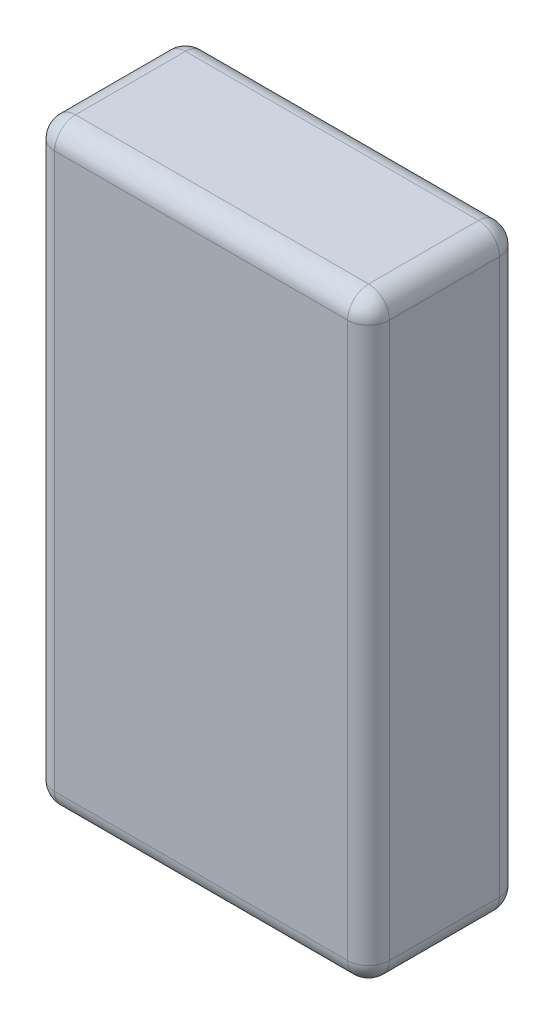
ISO-10303-21;
HEADER;
FILE_DESCRIPTION(('STEP AP214'),'2;1');
FILE_NAME('part.step','',(''),(''),'','','');
FILE_SCHEMA(('AUTOMOTIVE_DESIGN { 1 0 10303 214 1 1 1 1 }'));
ENDSEC;
DATA;
#1=APPLICATION_CONTEXT('core data for automotive mechanical design processes');
#2=APPLICATION_PROTOCOL_DEFINITION('international standard','automotive_design',2000,#1);
#3=PRODUCT_CONTEXT('',#1,'mechanical');
#4=PRODUCT('Part','Part','',(#3));
#5=PRODUCT_RELATED_PRODUCT_CATEGORY('part','',(#4));
#6=PRODUCT_DEFINITION_FORMATION('','',#4);
#7=PRODUCT_DEFINITION_CONTEXT('part definition',#1,'design');
#8=PRODUCT_DEFINITION('design','',#6,#7);
#9=PRODUCT_DEFINITION_SHAPE('','',#8);
#10=(LENGTH_UNIT() NAMED_UNIT(*) SI_UNIT(.MILLI.,.METRE.));
#11=(NAMED_UNIT(*) PLANE_ANGLE_UNIT() SI_UNIT($,.RADIAN.));
#12=(NAMED_UNIT(*) SI_UNIT($,.STERADIAN.) SOLID_ANGLE_UNIT());
#13=UNCERTAINTY_MEASURE_WITH_UNIT(LENGTH_MEASURE(1.E-05),#10,'distance_accuracy_value','');
#14=(GEOMETRIC_REPRESENTATION_CONTEXT(3) GLOBAL_UNCERTAINTY_ASSIGNED_CONTEXT((#13)) GLOBAL_UNIT_ASSIGNED_CONTEXT((#10,
#11,#12)) REPRESENTATION_CONTEXT('',''));
#15=CARTESIAN_POINT('',(0.,0.,0.));
#16=DIRECTION('',(0.,0.,1.));
#17=DIRECTION('',(1.,0.,0.));
#18=AXIS2_PLACEMENT_3D('',#15,#16,#17);
#19=CARTESIAN_POINT('',(0.,57.,0.));
#20=DIRECTION('',(1.,0.,0.));
#21=DIRECTION('',(0.,0.,-1.));
#22=AXIS2_PLACEMENT_3D('',#19,#20,#21);
#23=PLANE('',#22);
#24=DIRECTION('',(0.,0.,1.));
#25=VECTOR('',#24,1.);
#26=CARTESIAN_POINT('',(0.,55.,0.));
#27=LINE('',#26,#25);
#28=CARTESIAN_POINT('',(0.,55.,-2.));
#29=VERTEX_POINT('',#28);
#30=CARTESIAN_POINT('',(0.,55.,-12.5));
#31=VERTEX_POINT('',#30);
#32=EDGE_CURVE('E199',#29,#31,#27,.F.);
#33=ORIENTED_EDGE('',*,*,#32,.T.);
#34=DIRECTION('',(0.,-1.,0.));
#35=VECTOR('',#34,1.);
#36=CARTESIAN_POINT('',(0.,57.,-12.5));
#37=LINE('',#36,#35);
#38=CARTESIAN_POINT('',(0.,2.,-12.5));
#39=VERTEX_POINT('',#38);
#40=EDGE_CURVE('E201',#31,#39,#37,.T.);
#41=ORIENTED_EDGE('',*,*,#40,.T.);
#42=DIRECTION('',(0.,0.,1.));
#43=VECTOR('',#42,1.);
#44=CARTESIAN_POINT('',(0.,2.,0.));
#45=LINE('',#44,#43);
#46=CARTESIAN_POINT('',(0.,2.,-2.));
#47=VERTEX_POINT('',#46);
#48=EDGE_CURVE('E197',#39,#47,#45,.T.);
#49=ORIENTED_EDGE('',*,*,#48,.T.);
#50=DIRECTION('',(0.,-1.,0.));
#51=VECTOR('',#50,1.);
#52=CARTESIAN_POINT('',(0.,57.,-2.));
#53=LINE('',#52,#51);
#54=EDGE_CURVE('E195',#47,#29,#53,.F.);
#55=ORIENTED_EDGE('',*,*,#54,.T.);
#56=EDGE_LOOP('',(#33,#41,#49,#55));
#57=FACE_BOUND('',#56,.T.);
#58=ADVANCED_FACE('F43',(#57),#23,.F.);
#59=CARTESIAN_POINT('',(0.,57.,0.));
#60=DIRECTION('',(0.,0.,-1.));
#61=DIRECTION('',(-1.,0.,0.));
#62=AXIS2_PLACEMENT_3D('',#59,#60,#61);
#63=PLANE('',#62);
#64=DIRECTION('',(1.,0.,0.));
#65=VECTOR('',#64,1.);
#66=CARTESIAN_POINT('',(0.,55.,0.));
#67=LINE('',#66,#65);
#68=CARTESIAN_POINT('',(30.,55.,0.));
#69=VERTEX_POINT('',#68);
#70=CARTESIAN_POINT('',(2.,55.,0.));
#71=VERTEX_POINT('',#70);
#72=EDGE_CURVE('E52',#69,#71,#67,.F.);
#73=ORIENTED_EDGE('',*,*,#72,.T.);
#74=DIRECTION('',(0.,-1.,0.));
#75=VECTOR('',#74,1.);
#76=CARTESIAN_POINT('',(2.,57.,0.));
#77=LINE('',#76,#75);
#78=CARTESIAN_POINT('',(2.,2.,0.));
#79=VERTEX_POINT('',#78);
#80=EDGE_CURVE('E11',#71,#79,#77,.T.);
#81=ORIENTED_EDGE('',*,*,#80,.T.);
#82=DIRECTION('',(1.,0.,0.));
#83=VECTOR('',#82,1.);
#84=CARTESIAN_POINT('',(32.,2.,0.));
#85=LINE('',#84,#83);
#86=CARTESIAN_POINT('',(30.,2.,0.));
#87=VERTEX_POINT('',#86);
#88=EDGE_CURVE('E204',#79,#87,#85,.T.);
#89=ORIENTED_EDGE('',*,*,#88,.T.);
#90=DIRECTION('',(0.,-1.,0.));
#91=VECTOR('',#90,1.);
#92=CARTESIAN_POINT('',(30.,57.,0.));
#93=LINE('',#92,#91);
#94=EDGE_CURVE('E63',#87,#69,#93,.F.);
#95=ORIENTED_EDGE('',*,*,#94,.T.);
#96=EDGE_LOOP('',(#73,#81,#89,#95));
#97=FACE_BOUND('',#96,.T.);
#98=ADVANCED_FACE('F306',(#97),#63,.F.);
#99=CARTESIAN_POINT('',(32.,57.,0.));
#100=DIRECTION('',(-1.,0.,0.));
#101=DIRECTION('',(0.,0.,1.));
#102=AXIS2_PLACEMENT_3D('',#99,#100,#101);
#103=PLANE('',#102);
#104=DIRECTION('',(0.,0.,-1.));
#105=VECTOR('',#104,1.);
#106=CARTESIAN_POINT('',(32.,2.,-14.5));
#107=LINE('',#106,#105);
#108=CARTESIAN_POINT('',(32.,2.,-2.));
#109=VERTEX_POINT('',#108);
#110=CARTESIAN_POINT('',(32.,2.,-12.5));
#111=VERTEX_POINT('',#110);
#112=EDGE_CURVE('E181',#109,#111,#107,.T.);
#113=ORIENTED_EDGE('',*,*,#112,.T.);
#114=DIRECTION('',(0.,-1.,0.));
#115=VECTOR('',#114,1.);
#116=CARTESIAN_POINT('',(32.,57.,-12.5));
#117=LINE('',#116,#115);
#118=CARTESIAN_POINT('',(32.,55.,-12.5));
#119=VERTEX_POINT('',#118);
#120=EDGE_CURVE('E183',#111,#119,#117,.F.);
#121=ORIENTED_EDGE('',*,*,#120,.T.);
#122=DIRECTION('',(0.,0.,-1.));
#123=VECTOR('',#122,1.);
#124=CARTESIAN_POINT('',(32.,55.,0.));
#125=LINE('',#124,#123);
#126=CARTESIAN_POINT('',(32.,55.,-2.));
#127=VERTEX_POINT('',#126);
#128=EDGE_CURVE('E179',#119,#127,#125,.F.);
#129=ORIENTED_EDGE('',*,*,#128,.T.);
#130=DIRECTION('',(0.,-1.,0.));
#131=VECTOR('',#130,1.);
#132=CARTESIAN_POINT('',(32.,57.,-2.));
#133=LINE('',#132,#131);
#134=EDGE_CURVE('E177',#127,#109,#133,.T.);
#135=ORIENTED_EDGE('',*,*,#134,.T.);
#136=EDGE_LOOP('',(#113,#121,#129,#135));
#137=FACE_BOUND('',#136,.T.);
#138=ADVANCED_FACE('F278',(#137),#103,.F.);
#139=CARTESIAN_POINT('',(0.,57.,-14.5));
#140=DIRECTION('',(0.,0.,1.));
#141=DIRECTION('',(1.,0.,0.));
#142=AXIS2_PLACEMENT_3D('',#139,#140,#141);
#143=PLANE('',#142);
#144=DIRECTION('',(0.,-1.,0.));
#145=VECTOR('',#144,1.);
#146=CARTESIAN_POINT('',(30.,57.,-14.5));
#147=LINE('',#146,#145);
#148=CARTESIAN_POINT('',(30.,55.,-14.5));
#149=VERTEX_POINT('',#148);
#150=CARTESIAN_POINT('',(30.,2.,-14.5));
#151=VERTEX_POINT('',#150);
#152=EDGE_CURVE('E164',#149,#151,#147,.T.);
#153=ORIENTED_EDGE('',*,*,#152,.T.);
#154=DIRECTION('',(-1.,0.,0.));
#155=VECTOR('',#154,1.);
#156=CARTESIAN_POINT('',(0.,2.,-14.5));
#157=LINE('',#156,#155);
#158=CARTESIAN_POINT('',(2.,2.,-14.5));
#159=VERTEX_POINT('',#158);
#160=EDGE_CURVE('E136',#151,#159,#157,.T.);
#161=ORIENTED_EDGE('',*,*,#160,.T.);
#162=DIRECTION('',(0.,-1.,0.));
#163=VECTOR('',#162,1.);
#164=CARTESIAN_POINT('',(2.,57.,-14.5));
#165=LINE('',#164,#163);
#166=CARTESIAN_POINT('',(2.,55.,-14.5));
#167=VERTEX_POINT('',#166);
#168=EDGE_CURVE('E154',#159,#167,#165,.F.);
#169=ORIENTED_EDGE('',*,*,#168,.T.);
#170=DIRECTION('',(-1.,0.,0.));
#171=VECTOR('',#170,1.);
#172=CARTESIAN_POINT('',(0.,55.,-14.5));
#173=LINE('',#172,#171);
#174=EDGE_CURVE('E160',#167,#149,#173,.F.);
#175=ORIENTED_EDGE('',*,*,#174,.T.);
#176=EDGE_LOOP('',(#153,#161,#169,#175));
#177=FACE_BOUND('',#176,.T.);
#178=ADVANCED_FACE('F162',(#177),#143,.F.);
#179=CARTESIAN_POINT('',(0.,57.,0.));
#180=DIRECTION('',(0.,-1.,0.));
#181=DIRECTION('',(0.,0.,-1.));
#182=AXIS2_PLACEMENT_3D('',#179,#180,#181);
#183=PLANE('',#182);
#184=DIRECTION('',(0.,0.,-1.));
#185=VECTOR('',#184,1.);
#186=CARTESIAN_POINT('',(30.,57.,0.));
#187=LINE('',#186,#185);
#188=CARTESIAN_POINT('',(30.,57.,-2.));
#189=VERTEX_POINT('',#188);
#190=CARTESIAN_POINT('',(30.,57.,-12.5));
#191=VERTEX_POINT('',#190);
#192=EDGE_CURVE('E190',#189,#191,#187,.T.);
#193=ORIENTED_EDGE('',*,*,#192,.T.);
#194=DIRECTION('',(-1.,0.,0.));
#195=VECTOR('',#194,1.);
#196=CARTESIAN_POINT('',(0.,57.,-12.5));
#197=LINE('',#196,#195);
#198=CARTESIAN_POINT('',(2.,57.,-12.5));
#199=VERTEX_POINT('',#198);
#200=EDGE_CURVE('E192',#191,#199,#197,.T.);
#201=ORIENTED_EDGE('',*,*,#200,.T.);
#202=DIRECTION('',(0.,0.,1.));
#203=VECTOR('',#202,1.);
#204=CARTESIAN_POINT('',(2.,57.,0.));
#205=LINE('',#204,#203);
#206=CARTESIAN_POINT('',(2.,57.,-2.));
#207=VERTEX_POINT('',#206);
#208=EDGE_CURVE('E188',#199,#207,#205,.T.);
#209=ORIENTED_EDGE('',*,*,#208,.T.);
#210=DIRECTION('',(1.,0.,0.));
#211=VECTOR('',#210,1.);
#212=CARTESIAN_POINT('',(0.,57.,-2.));
#213=LINE('',#212,#211);
#214=EDGE_CURVE('E186',#207,#189,#213,.T.);
#215=ORIENTED_EDGE('',*,*,#214,.T.);
#216=EDGE_LOOP('',(#193,#201,#209,#215));
#217=FACE_BOUND('',#216,.T.);
#218=ADVANCED_FACE('F287',(#217),#183,.F.);
#219=CARTESIAN_POINT('',(0.,0.,0.));
#220=DIRECTION('',(0.,-1.,0.));
#221=DIRECTION('',(0.,0.,-1.));
#222=AXIS2_PLACEMENT_3D('',#219,#220,#221);
#223=PLANE('',#222);
#224=DIRECTION('',(0.,0.,1.));
#225=VECTOR('',#224,1.);
#226=CARTESIAN_POINT('',(2.,0.,-14.5));
#227=LINE('',#226,#225);
#228=CARTESIAN_POINT('',(2.,0.,-2.));
#229=VERTEX_POINT('',#228);
#230=CARTESIAN_POINT('',(2.,0.,-12.5));
#231=VERTEX_POINT('',#230);
#232=EDGE_CURVE('E168',#229,#231,#227,.F.);
#233=ORIENTED_EDGE('',*,*,#232,.T.);
#234=DIRECTION('',(-1.,0.,0.));
#235=VECTOR('',#234,1.);
#236=CARTESIAN_POINT('',(32.,0.,-12.5));
#237=LINE('',#236,#235);
#238=CARTESIAN_POINT('',(30.,0.,-12.5));
#239=VERTEX_POINT('',#238);
#240=EDGE_CURVE('E138',#231,#239,#237,.F.);
#241=ORIENTED_EDGE('',*,*,#240,.T.);
#242=DIRECTION('',(0.,0.,-1.));
#243=VECTOR('',#242,1.);
#244=CARTESIAN_POINT('',(30.,0.,0.));
#245=LINE('',#244,#243);
#246=CARTESIAN_POINT('',(30.,0.,-2.));
#247=VERTEX_POINT('',#246);
#248=EDGE_CURVE('E174',#239,#247,#245,.F.);
#249=ORIENTED_EDGE('',*,*,#248,.T.);
#250=DIRECTION('',(1.,0.,0.));
#251=VECTOR('',#250,1.);
#252=CARTESIAN_POINT('',(0.,0.,-2.));
#253=LINE('',#252,#251);
#254=EDGE_CURVE('E166',#247,#229,#253,.F.);
#255=ORIENTED_EDGE('',*,*,#254,.T.);
#256=EDGE_LOOP('',(#233,#241,#249,#255));
#257=FACE_BOUND('',#256,.T.);
#258=ADVANCED_FACE('F366',(#257),#223,.T.);
#259=CARTESIAN_POINT('',(0.,55.,-2.));
#260=DIRECTION('',(1.,0.,0.));
#261=DIRECTION('',(0.,0.,-1.));
#262=AXIS2_PLACEMENT_3D('',#259,#260,#261);
#263=CYLINDRICAL_SURFACE('',#262,2.);
#264=CARTESIAN_POINT('',(30.,55.,-2.));
#265=DIRECTION('',(1.,0.,0.));
#266=DIRECTION('',(0.,0.,-1.));
#267=AXIS2_PLACEMENT_3D('',#264,#265,#266);
#268=CIRCLE('',#267,2.);
#269=EDGE_CURVE('E47',#189,#69,#268,.T.);
#270=ORIENTED_EDGE('',*,*,#269,.F.);
#271=ORIENTED_EDGE('',*,*,#214,.F.);
#272=CARTESIAN_POINT('',(2.,55.,-2.));
#273=DIRECTION('',(-1.,0.,0.));
#274=DIRECTION('',(0.,-1.,0.));
#275=AXIS2_PLACEMENT_3D('',#272,#273,#274);
#276=CIRCLE('',#275,2.);
#277=EDGE_CURVE('E257',#71,#207,#276,.T.);
#278=ORIENTED_EDGE('',*,*,#277,.F.);
#279=ORIENTED_EDGE('',*,*,#72,.F.);
#280=EDGE_LOOP('',(#270,#271,#278,#279));
#281=FACE_BOUND('',#280,.T.);
#282=ADVANCED_FACE('F45',(#281),#263,.T.);
#283=CARTESIAN_POINT('',(30.,55.,-2.));
#284=DIRECTION('',(0.,0.,1.));
#285=DIRECTION('',(1.,0.,0.));
#286=AXIS2_PLACEMENT_3D('',#283,#284,#285);
#287=SPHERICAL_SURFACE('',#286,2.);
#288=CARTESIAN_POINT('',(30.,55.,-2.));
#289=DIRECTION('',(0.,0.,1.));
#290=DIRECTION('',(0.,-1.,0.));
#291=AXIS2_PLACEMENT_3D('',#288,#289,#290);
#292=CIRCLE('',#291,2.);
#293=EDGE_CURVE('E252',#189,#127,#292,.F.);
#294=ORIENTED_EDGE('',*,*,#293,.F.);
#295=ORIENTED_EDGE('',*,*,#269,.T.);
#296=CARTESIAN_POINT('',(30.,55.,-2.));
#297=DIRECTION('',(0.,1.,0.));
#298=DIRECTION('',(0.,0.,1.));
#299=AXIS2_PLACEMENT_3D('',#296,#297,#298);
#300=CIRCLE('',#299,2.);
#301=EDGE_CURVE('E255',#127,#69,#300,.F.);
#302=ORIENTED_EDGE('',*,*,#301,.F.);
#303=EDGE_LOOP('',(#294,#295,#302));
#304=FACE_BOUND('',#303,.T.);
#305=ADVANCED_FACE('F267',(#304),#287,.T.);
#306=CARTESIAN_POINT('',(2.,55.,-2.));
#307=DIRECTION('',(0.,1.,0.));
#308=DIRECTION('',(0.,0.,1.));
#309=AXIS2_PLACEMENT_3D('',#306,#307,#308);
#310=SPHERICAL_SURFACE('',#309,2.);
#311=CARTESIAN_POINT('',(2.,55.,-2.));
#312=DIRECTION('',(0.,1.,0.));
#313=DIRECTION('',(0.,0.,1.));
#314=AXIS2_PLACEMENT_3D('',#311,#312,#313);
#315=CIRCLE('',#314,2.);
#316=EDGE_CURVE('E246',#71,#29,#315,.F.);
#317=ORIENTED_EDGE('',*,*,#316,.F.);
#318=ORIENTED_EDGE('',*,*,#277,.T.);
#319=CARTESIAN_POINT('',(2.,55.,-2.));
#320=DIRECTION('',(0.,0.,1.));
#321=DIRECTION('',(1.,0.,0.));
#322=AXIS2_PLACEMENT_3D('',#319,#320,#321);
#323=CIRCLE('',#322,2.);
#324=EDGE_CURVE('E249',#29,#207,#323,.F.);
#325=ORIENTED_EDGE('',*,*,#324,.F.);
#326=EDGE_LOOP('',(#317,#318,#325));
#327=FACE_BOUND('',#326,.T.);
#328=ADVANCED_FACE('F300',(#327),#310,.T.);
#329=CARTESIAN_POINT('',(30.,57.,-2.));
#330=DIRECTION('',(0.,-1.,0.));
#331=DIRECTION('',(0.,0.,-1.));
#332=AXIS2_PLACEMENT_3D('',#329,#330,#331);
#333=CYLINDRICAL_SURFACE('',#332,2.);
#334=ORIENTED_EDGE('',*,*,#301,.T.);
#335=ORIENTED_EDGE('',*,*,#94,.F.);
#336=CARTESIAN_POINT('',(30.,2.,-2.));
#337=DIRECTION('',(0.,-1.,0.));
#338=DIRECTION('',(0.,0.,-1.));
#339=AXIS2_PLACEMENT_3D('',#336,#337,#338);
#340=CIRCLE('',#339,2.);
#341=EDGE_CURVE('E240',#109,#87,#340,.T.);
#342=ORIENTED_EDGE('',*,*,#341,.F.);
#343=ORIENTED_EDGE('',*,*,#134,.F.);
#344=EDGE_LOOP('',(#334,#335,#342,#343));
#345=FACE_BOUND('',#344,.T.);
#346=ADVANCED_FACE('F273',(#345),#333,.T.);
#347=CARTESIAN_POINT('',(30.,55.,0.));
#348=DIRECTION('',(0.,0.,-1.));
#349=DIRECTION('',(-1.,0.,0.));
#350=AXIS2_PLACEMENT_3D('',#347,#348,#349);
#351=CYLINDRICAL_SURFACE('',#350,2.);
#352=ORIENTED_EDGE('',*,*,#293,.T.);
#353=ORIENTED_EDGE('',*,*,#128,.F.);
#354=CARTESIAN_POINT('',(30.,55.,-12.5));
#355=DIRECTION('',(0.,0.,-1.));
#356=DIRECTION('',(-1.,0.,0.));
#357=AXIS2_PLACEMENT_3D('',#354,#355,#356);
#358=CIRCLE('',#357,2.);
#359=EDGE_CURVE('E237',#191,#119,#358,.T.);
#360=ORIENTED_EDGE('',*,*,#359,.F.);
#361=ORIENTED_EDGE('',*,*,#192,.F.);
#362=EDGE_LOOP('',(#352,#353,#360,#361));
#363=FACE_BOUND('',#362,.T.);
#364=ADVANCED_FACE('F284',(#363),#351,.T.);
#365=CARTESIAN_POINT('',(0.,55.,-12.5));
#366=DIRECTION('',(-1.,0.,0.));
#367=DIRECTION('',(0.,0.,1.));
#368=AXIS2_PLACEMENT_3D('',#365,#366,#367);
#369=CYLINDRICAL_SURFACE('',#368,2.);
#370=CARTESIAN_POINT('',(2.,55.,-12.5));
#371=DIRECTION('',(-1.,0.,0.));
#372=DIRECTION('',(0.,0.,1.));
#373=AXIS2_PLACEMENT_3D('',#370,#371,#372);
#374=CIRCLE('',#373,2.);
#375=EDGE_CURVE('E231',#199,#167,#374,.T.);
#376=ORIENTED_EDGE('',*,*,#375,.F.);
#377=ORIENTED_EDGE('',*,*,#200,.F.);
#378=CARTESIAN_POINT('',(30.,55.,-12.5));
#379=DIRECTION('',(1.,0.,0.));
#380=DIRECTION('',(0.,0.,-1.));
#381=AXIS2_PLACEMENT_3D('',#378,#379,#380);
#382=CIRCLE('',#381,2.);
#383=EDGE_CURVE('E234',#149,#191,#382,.T.);
#384=ORIENTED_EDGE('',*,*,#383,.F.);
#385=ORIENTED_EDGE('',*,*,#174,.F.);
#386=EDGE_LOOP('',(#376,#377,#384,#385));
#387=FACE_BOUND('',#386,.T.);
#388=ADVANCED_FACE('F291',(#387),#369,.T.);
#389=CARTESIAN_POINT('',(2.,55.,0.));
#390=DIRECTION('',(0.,0.,1.));
#391=DIRECTION('',(1.,0.,0.));
#392=AXIS2_PLACEMENT_3D('',#389,#390,#391);
#393=CYLINDRICAL_SURFACE('',#392,2.);
#394=ORIENTED_EDGE('',*,*,#324,.T.);
#395=ORIENTED_EDGE('',*,*,#208,.F.);
#396=CARTESIAN_POINT('',(2.,55.,-12.5));
#397=DIRECTION('',(0.,0.,-1.));
#398=DIRECTION('',(-1.,0.,0.));
#399=AXIS2_PLACEMENT_3D('',#396,#397,#398);
#400=CIRCLE('',#399,2.);
#401=EDGE_CURVE('E229',#31,#199,#400,.T.);
#402=ORIENTED_EDGE('',*,*,#401,.F.);
#403=ORIENTED_EDGE('',*,*,#32,.F.);
#404=EDGE_LOOP('',(#394,#395,#402,#403));
#405=FACE_BOUND('',#404,.T.);
#406=ADVANCED_FACE('F297',(#405),#393,.T.);
#407=CARTESIAN_POINT('',(2.,57.,-2.));
#408=DIRECTION('',(0.,-1.,0.));
#409=DIRECTION('',(0.,0.,-1.));
#410=AXIS2_PLACEMENT_3D('',#407,#408,#409);
#411=CYLINDRICAL_SURFACE('',#410,2.);
#412=ORIENTED_EDGE('',*,*,#316,.T.);
#413=ORIENTED_EDGE('',*,*,#54,.F.);
#414=CARTESIAN_POINT('',(2.,2.,-2.));
#415=DIRECTION('',(0.,-1.,0.));
#416=DIRECTION('',(0.,0.,-1.));
#417=AXIS2_PLACEMENT_3D('',#414,#415,#416);
#418=CIRCLE('',#417,2.);
#419=EDGE_CURVE('E226',#79,#47,#418,.T.);
#420=ORIENTED_EDGE('',*,*,#419,.F.);
#421=ORIENTED_EDGE('',*,*,#80,.F.);
#422=EDGE_LOOP('',(#412,#413,#420,#421));
#423=FACE_BOUND('',#422,.T.);
#424=ADVANCED_FACE('F304',(#423),#411,.T.);
#425=CARTESIAN_POINT('',(0.,2.,-2.));
#426=DIRECTION('',(-1.,0.,0.));
#427=DIRECTION('',(0.,0.,1.));
#428=AXIS2_PLACEMENT_3D('',#425,#426,#427);
#429=CYLINDRICAL_SURFACE('',#428,2.);
#430=CARTESIAN_POINT('',(30.,2.,-2.));
#431=DIRECTION('',(1.,0.,0.));
#432=DIRECTION('',(0.,0.,-1.));
#433=AXIS2_PLACEMENT_3D('',#430,#431,#432);
#434=CIRCLE('',#433,2.);
#435=EDGE_CURVE('E243',#87,#247,#434,.T.);
#436=ORIENTED_EDGE('',*,*,#435,.F.);
#437=ORIENTED_EDGE('',*,*,#88,.F.);
#438=CARTESIAN_POINT('',(2.,2.,-2.));
#439=DIRECTION('',(-1.,0.,0.));
#440=DIRECTION('',(0.,0.,1.));
#441=AXIS2_PLACEMENT_3D('',#438,#439,#440);
#442=CIRCLE('',#441,2.);
#443=EDGE_CURVE('E224',#229,#79,#442,.T.);
#444=ORIENTED_EDGE('',*,*,#443,.F.);
#445=ORIENTED_EDGE('',*,*,#254,.F.);
#446=EDGE_LOOP('',(#436,#437,#444,#445));
#447=FACE_BOUND('',#446,.T.);
#448=ADVANCED_FACE('F309',(#447),#429,.T.);
#449=CARTESIAN_POINT('',(30.,2.,-2.));
#450=DIRECTION('',(0.,0.,1.));
#451=DIRECTION('',(0.,-1.,0.));
#452=AXIS2_PLACEMENT_3D('',#449,#450,#451);
#453=SPHERICAL_SURFACE('',#452,2.);
#454=ORIENTED_EDGE('',*,*,#341,.T.);
#455=ORIENTED_EDGE('',*,*,#435,.T.);
#456=CARTESIAN_POINT('',(30.,2.,-2.));
#457=DIRECTION('',(0.,0.,1.));
#458=DIRECTION('',(1.,0.,0.));
#459=AXIS2_PLACEMENT_3D('',#456,#457,#458);
#460=CIRCLE('',#459,2.);
#461=EDGE_CURVE('E221',#109,#247,#460,.F.);
#462=ORIENTED_EDGE('',*,*,#461,.F.);
#463=EDGE_LOOP('',(#454,#455,#462));
#464=FACE_BOUND('',#463,.T.);
#465=ADVANCED_FACE('F313',(#464),#453,.T.);
#466=CARTESIAN_POINT('',(30.,55.,-12.5));
#467=DIRECTION('',(0.,1.,0.));
#468=DIRECTION('',(0.,0.,1.));
#469=AXIS2_PLACEMENT_3D('',#466,#467,#468);
#470=SPHERICAL_SURFACE('',#469,2.);
#471=ORIENTED_EDGE('',*,*,#383,.T.);
#472=ORIENTED_EDGE('',*,*,#359,.T.);
#473=CARTESIAN_POINT('',(30.,55.,-12.5));
#474=DIRECTION('',(0.,1.,0.));
#475=DIRECTION('',(0.,0.,1.));
#476=AXIS2_PLACEMENT_3D('',#473,#474,#475);
#477=CIRCLE('',#476,2.);
#478=EDGE_CURVE('E219',#149,#119,#477,.F.);
#479=ORIENTED_EDGE('',*,*,#478,.F.);
#480=EDGE_LOOP('',(#471,#472,#479));
#481=FACE_BOUND('',#480,.T.);
#482=ADVANCED_FACE('F324',(#481),#470,.T.);
#483=CARTESIAN_POINT('',(2.,55.,-12.5));
#484=DIRECTION('',(0.,1.,0.));
#485=DIRECTION('',(0.,0.,1.));
#486=AXIS2_PLACEMENT_3D('',#483,#484,#485);
#487=SPHERICAL_SURFACE('',#486,2.);
#488=ORIENTED_EDGE('',*,*,#401,.T.);
#489=ORIENTED_EDGE('',*,*,#375,.T.);
#490=CARTESIAN_POINT('',(2.,55.,-12.5));
#491=DIRECTION('',(0.,1.,0.));
#492=DIRECTION('',(0.,0.,1.));
#493=AXIS2_PLACEMENT_3D('',#490,#491,#492);
#494=CIRCLE('',#493,2.);
#495=EDGE_CURVE('E157',#31,#167,#494,.F.);
#496=ORIENTED_EDGE('',*,*,#495,.F.);
#497=EDGE_LOOP('',(#488,#489,#496));
#498=FACE_BOUND('',#497,.T.);
#499=ADVANCED_FACE('F326',(#498),#487,.T.);
#500=CARTESIAN_POINT('',(2.,2.,-2.));
#501=DIRECTION('',(0.,0.,1.));
#502=DIRECTION('',(0.,-1.,0.));
#503=AXIS2_PLACEMENT_3D('',#500,#501,#502);
#504=SPHERICAL_SURFACE('',#503,2.);
#505=ORIENTED_EDGE('',*,*,#443,.T.);
#506=ORIENTED_EDGE('',*,*,#419,.T.);
#507=CARTESIAN_POINT('',(2.,2.,-2.));
#508=DIRECTION('',(0.,0.,1.));
#509=DIRECTION('',(1.,0.,0.));
#510=AXIS2_PLACEMENT_3D('',#507,#508,#509);
#511=CIRCLE('',#510,2.);
#512=EDGE_CURVE('E215',#229,#47,#511,.F.);
#513=ORIENTED_EDGE('',*,*,#512,.F.);
#514=EDGE_LOOP('',(#505,#506,#513));
#515=FACE_BOUND('',#514,.T.);
#516=ADVANCED_FACE('F332',(#515),#504,.T.);
#517=CARTESIAN_POINT('',(30.,2.,0.));
#518=DIRECTION('',(0.,0.,1.));
#519=DIRECTION('',(1.,0.,0.));
#520=AXIS2_PLACEMENT_3D('',#517,#518,#519);
#521=CYLINDRICAL_SURFACE('',#520,2.);
#522=ORIENTED_EDGE('',*,*,#461,.T.);
#523=ORIENTED_EDGE('',*,*,#248,.F.);
#524=CARTESIAN_POINT('',(30.,2.,-12.5));
#525=DIRECTION('',(0.,0.,-1.));
#526=DIRECTION('',(-1.,0.,0.));
#527=AXIS2_PLACEMENT_3D('',#524,#525,#526);
#528=CIRCLE('',#527,2.);
#529=EDGE_CURVE('E212',#111,#239,#528,.T.);
#530=ORIENTED_EDGE('',*,*,#529,.F.);
#531=ORIENTED_EDGE('',*,*,#112,.F.);
#532=EDGE_LOOP('',(#522,#523,#530,#531));
#533=FACE_BOUND('',#532,.T.);
#534=ADVANCED_FACE('F317',(#533),#521,.T.);
#535=CARTESIAN_POINT('',(30.,57.,-12.5));
#536=DIRECTION('',(0.,-1.,0.));
#537=DIRECTION('',(0.,0.,-1.));
#538=AXIS2_PLACEMENT_3D('',#535,#536,#537);
#539=CYLINDRICAL_SURFACE('',#538,2.);
#540=ORIENTED_EDGE('',*,*,#478,.T.);
#541=ORIENTED_EDGE('',*,*,#120,.F.);
#542=CARTESIAN_POINT('',(30.,2.,-12.5));
#543=DIRECTION('',(0.,-1.,0.));
#544=DIRECTION('',(0.,0.,-1.));
#545=AXIS2_PLACEMENT_3D('',#542,#543,#544);
#546=CIRCLE('',#545,2.);
#547=EDGE_CURVE('E151',#151,#111,#546,.T.);
#548=ORIENTED_EDGE('',*,*,#547,.F.);
#549=ORIENTED_EDGE('',*,*,#152,.F.);
#550=EDGE_LOOP('',(#540,#541,#548,#549));
#551=FACE_BOUND('',#550,.T.);
#552=ADVANCED_FACE('F322',(#551),#539,.T.);
#553=CARTESIAN_POINT('',(2.,57.,-12.5));
#554=DIRECTION('',(0.,-1.,0.));
#555=DIRECTION('',(0.,0.,-1.));
#556=AXIS2_PLACEMENT_3D('',#553,#554,#555);
#557=CYLINDRICAL_SURFACE('',#556,2.);
#558=ORIENTED_EDGE('',*,*,#495,.T.);
#559=ORIENTED_EDGE('',*,*,#168,.F.);
#560=CARTESIAN_POINT('',(2.,2.,-12.5));
#561=DIRECTION('',(0.,-1.,0.));
#562=DIRECTION('',(0.,0.,-1.));
#563=AXIS2_PLACEMENT_3D('',#560,#561,#562);
#564=CIRCLE('',#563,2.);
#565=EDGE_CURVE('E143',#39,#159,#564,.T.);
#566=ORIENTED_EDGE('',*,*,#565,.F.);
#567=ORIENTED_EDGE('',*,*,#40,.F.);
#568=EDGE_LOOP('',(#558,#559,#566,#567));
#569=FACE_BOUND('',#568,.T.);
#570=ADVANCED_FACE('F155',(#569),#557,.T.);
#571=CARTESIAN_POINT('',(2.,2.,0.));
#572=DIRECTION('',(0.,0.,-1.));
#573=DIRECTION('',(-1.,0.,0.));
#574=AXIS2_PLACEMENT_3D('',#571,#572,#573);
#575=CYLINDRICAL_SURFACE('',#574,2.);
#576=ORIENTED_EDGE('',*,*,#512,.T.);
#577=ORIENTED_EDGE('',*,*,#48,.F.);
#578=CARTESIAN_POINT('',(2.,2.,-12.5));
#579=DIRECTION('',(0.,0.,-1.));
#580=DIRECTION('',(-1.,0.,0.));
#581=AXIS2_PLACEMENT_3D('',#578,#579,#580);
#582=CIRCLE('',#581,2.);
#583=EDGE_CURVE('E147',#231,#39,#582,.T.);
#584=ORIENTED_EDGE('',*,*,#583,.F.);
#585=ORIENTED_EDGE('',*,*,#232,.F.);
#586=EDGE_LOOP('',(#576,#577,#584,#585));
#587=FACE_BOUND('',#586,.T.);
#588=ADVANCED_FACE('F350',(#587),#575,.T.);
#589=CARTESIAN_POINT('',(30.,2.,-12.5));
#590=DIRECTION('',(1.,0.,0.));
#591=DIRECTION('',(0.,1.,0.));
#592=AXIS2_PLACEMENT_3D('',#589,#590,#591);
#593=SPHERICAL_SURFACE('',#592,2.);
#594=ORIENTED_EDGE('',*,*,#547,.T.);
#595=ORIENTED_EDGE('',*,*,#529,.T.);
#596=CARTESIAN_POINT('',(30.,2.,-12.5));
#597=DIRECTION('',(1.,0.,0.));
#598=DIRECTION('',(0.,0.,-1.));
#599=AXIS2_PLACEMENT_3D('',#596,#597,#598);
#600=CIRCLE('',#599,2.);
#601=EDGE_CURVE('E140',#151,#239,#600,.F.);
#602=ORIENTED_EDGE('',*,*,#601,.F.);
#603=EDGE_LOOP('',(#594,#595,#602));
#604=FACE_BOUND('',#603,.T.);
#605=ADVANCED_FACE('F320',(#604),#593,.T.);
#606=CARTESIAN_POINT('',(2.,2.,-12.5));
#607=DIRECTION('',(-1.,0.,0.));
#608=DIRECTION('',(0.,-1.,0.));
#609=AXIS2_PLACEMENT_3D('',#606,#607,#608);
#610=SPHERICAL_SURFACE('',#609,2.);
#611=ORIENTED_EDGE('',*,*,#583,.T.);
#612=ORIENTED_EDGE('',*,*,#565,.T.);
#613=CARTESIAN_POINT('',(2.,2.,-12.5));
#614=DIRECTION('',(-1.,0.,0.));
#615=DIRECTION('',(0.,0.,1.));
#616=AXIS2_PLACEMENT_3D('',#613,#614,#615);
#617=CIRCLE('',#616,2.);
#618=EDGE_CURVE('E132',#231,#159,#617,.F.);
#619=ORIENTED_EDGE('',*,*,#618,.F.);
#620=EDGE_LOOP('',(#611,#612,#619));
#621=FACE_BOUND('',#620,.T.);
#622=ADVANCED_FACE('F145',(#621),#610,.T.);
#623=CARTESIAN_POINT('',(0.,2.,-12.5));
#624=DIRECTION('',(1.,0.,0.));
#625=DIRECTION('',(0.,0.,-1.));
#626=AXIS2_PLACEMENT_3D('',#623,#624,#625);
#627=CYLINDRICAL_SURFACE('',#626,2.);
#628=ORIENTED_EDGE('',*,*,#601,.T.);
#629=ORIENTED_EDGE('',*,*,#240,.F.);
#630=ORIENTED_EDGE('',*,*,#618,.T.);
#631=ORIENTED_EDGE('',*,*,#160,.F.);
#632=EDGE_LOOP('',(#628,#629,#630,#631));
#633=FACE_BOUND('',#632,.T.);
#634=ADVANCED_FACE('F134',(#633),#627,.T.);
#635=CLOSED_SHELL('',(#58,#98,#138,#178,#218,#258,#282,#305,#328,#346,#364,#388,#406,#424,#448,
#465,#482,#499,#516,#534,#552,#570,#588,#605,#622,#634));
#636=MANIFOLD_SOLID_BREP('B2',#635);
#637=ADVANCED_BREP_SHAPE_REPRESENTATION('',(#18,#636),#14);
#638=SHAPE_DEFINITION_REPRESENTATION(#9,#637);
ENDSEC;
END-ISO-10303-21;
